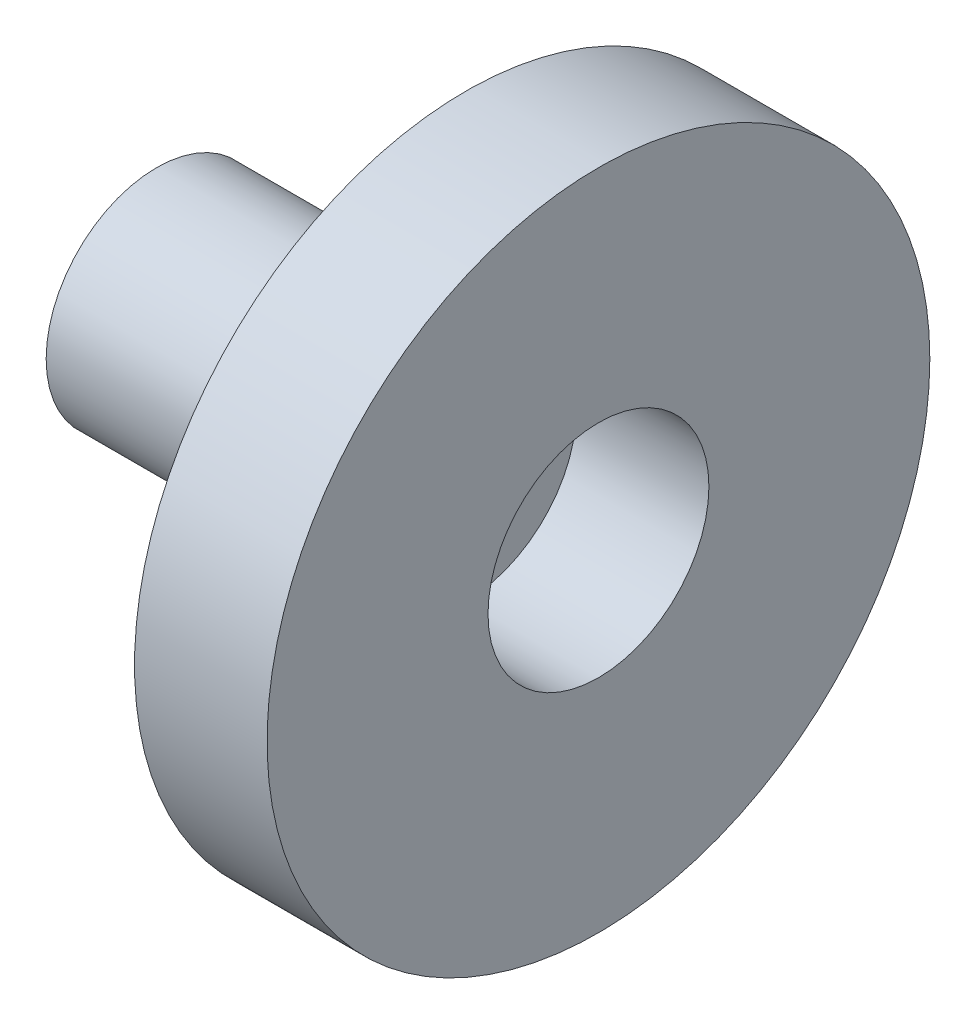
ISO-10303-21;
HEADER;
FILE_DESCRIPTION(('STEP AP214'),'2;1');
FILE_NAME('part.step','',(''),(''),'','','');
FILE_SCHEMA(('AUTOMOTIVE_DESIGN { 1 0 10303 214 1 1 1 1 }'));
ENDSEC;
DATA;
#1=APPLICATION_CONTEXT('core data for automotive mechanical design processes');
#2=APPLICATION_PROTOCOL_DEFINITION('international standard','automotive_design',2000,#1);
#3=PRODUCT_CONTEXT('',#1,'mechanical');
#4=PRODUCT('Part','Part','',(#3));
#5=PRODUCT_RELATED_PRODUCT_CATEGORY('part','',(#4));
#6=PRODUCT_DEFINITION_FORMATION('','',#4);
#7=PRODUCT_DEFINITION_CONTEXT('part definition',#1,'design');
#8=PRODUCT_DEFINITION('design','',#6,#7);
#9=PRODUCT_DEFINITION_SHAPE('','',#8);
#10=(LENGTH_UNIT() NAMED_UNIT(*) SI_UNIT(.MILLI.,.METRE.));
#11=(NAMED_UNIT(*) PLANE_ANGLE_UNIT() SI_UNIT($,.RADIAN.));
#12=(NAMED_UNIT(*) SI_UNIT($,.STERADIAN.) SOLID_ANGLE_UNIT());
#13=UNCERTAINTY_MEASURE_WITH_UNIT(LENGTH_MEASURE(1.E-05),#10,'distance_accuracy_value','');
#14=(GEOMETRIC_REPRESENTATION_CONTEXT(3) GLOBAL_UNCERTAINTY_ASSIGNED_CONTEXT((#13)) GLOBAL_UNIT_ASSIGNED_CONTEXT((#10,
#11,#12)) REPRESENTATION_CONTEXT('',''));
#15=CARTESIAN_POINT('',(0.,0.,0.));
#16=DIRECTION('',(0.,0.,1.));
#17=DIRECTION('',(1.,0.,0.));
#18=AXIS2_PLACEMENT_3D('',#15,#16,#17);
#19=CARTESIAN_POINT('',(-14.,0.,0.));
#20=DIRECTION('',(1.,0.,0.));
#21=DIRECTION('',(0.,0.,-1.));
#22=AXIS2_PLACEMENT_3D('',#19,#20,#21);
#23=CYLINDRICAL_SURFACE('',#22,5.);
#24=CARTESIAN_POINT('',(-14.,0.,0.));
#25=DIRECTION('',(-1.,0.,0.));
#26=DIRECTION('',(0.,0.,1.));
#27=AXIS2_PLACEMENT_3D('',#24,#25,#26);
#28=CIRCLE('',#27,5.);
#29=CARTESIAN_POINT('',(-14.,0.,5.));
#30=VERTEX_POINT('',#29);
#31=EDGE_CURVE('E11',#30,#30,#28,.T.);
#32=ORIENTED_EDGE('',*,*,#31,.F.);
#33=EDGE_LOOP('',(#32));
#34=FACE_BOUND('',#33,.T.);
#35=CARTESIAN_POINT('',(0.,0.,0.));
#36=DIRECTION('',(-1.,0.,0.));
#37=DIRECTION('',(0.,0.,1.));
#38=AXIS2_PLACEMENT_3D('',#35,#36,#37);
#39=CIRCLE('',#38,5.);
#40=CARTESIAN_POINT('',(0.,0.,5.));
#41=VERTEX_POINT('',#40);
#42=EDGE_CURVE('E46',#41,#41,#39,.T.);
#43=ORIENTED_EDGE('',*,*,#42,.T.);
#44=EDGE_LOOP('',(#43));
#45=FACE_BOUND('',#44,.T.);
#46=ADVANCED_FACE('F43',(#34,#45),#23,.T.);
#47=CARTESIAN_POINT('',(-14.,0.,0.));
#48=DIRECTION('',(-1.,0.,0.));
#49=DIRECTION('',(0.,0.,1.));
#50=AXIS2_PLACEMENT_3D('',#47,#48,#49);
#51=PLANE('',#50);
#52=ORIENTED_EDGE('',*,*,#31,.T.);
#53=EDGE_LOOP('',(#52));
#54=FACE_BOUND('',#53,.T.);
#55=ADVANCED_FACE('F58',(#54),#51,.T.);
#56=CARTESIAN_POINT('',(0.,0.,0.));
#57=DIRECTION('',(-1.,0.,0.));
#58=DIRECTION('',(0.,0.,1.));
#59=AXIS2_PLACEMENT_3D('',#56,#57,#58);
#60=PLANE('',#59);
#61=ORIENTED_EDGE('',*,*,#42,.F.);
#62=EDGE_LOOP('',(#61));
#63=FACE_BOUND('',#62,.T.);
#64=ADVANCED_FACE('F56',(#63),#60,.F.);
#65=CLOSED_SHELL('',(#46,#55,#64));
#66=MANIFOLD_SOLID_BREP('B2',#65);
#67=CARTESIAN_POINT('',(6.,0.,0.));
#68=DIRECTION('',(-1.,0.,0.));
#69=DIRECTION('',(0.,0.,1.));
#70=AXIS2_PLACEMENT_3D('',#67,#68,#69);
#71=CYLINDRICAL_SURFACE('',#70,15.);
#72=CARTESIAN_POINT('',(6.,0.,0.));
#73=DIRECTION('',(1.,0.,0.));
#74=DIRECTION('',(0.,0.,-1.));
#75=AXIS2_PLACEMENT_3D('',#72,#73,#74);
#76=CIRCLE('',#75,15.);
#77=CARTESIAN_POINT('',(6.,0.,-15.));
#78=VERTEX_POINT('',#77);
#79=EDGE_CURVE('E42',#78,#78,#76,.T.);
#80=ORIENTED_EDGE('',*,*,#79,.F.);
#81=EDGE_LOOP('',(#80));
#82=FACE_BOUND('',#81,.T.);
#83=CARTESIAN_POINT('',(0.,0.,0.));
#84=DIRECTION('',(1.,0.,0.));
#85=DIRECTION('',(0.,0.,-1.));
#86=AXIS2_PLACEMENT_3D('',#83,#84,#85);
#87=CIRCLE('',#86,15.);
#88=CARTESIAN_POINT('',(0.,0.,-15.));
#89=VERTEX_POINT('',#88);
#90=EDGE_CURVE('E87',#89,#89,#87,.T.);
#91=ORIENTED_EDGE('',*,*,#90,.T.);
#92=EDGE_LOOP('',(#91));
#93=FACE_BOUND('',#92,.T.);
#94=ADVANCED_FACE('F84',(#82,#93),#71,.T.);
#95=CARTESIAN_POINT('',(6.,0.,0.));
#96=DIRECTION('',(1.,0.,0.));
#97=DIRECTION('',(0.,0.,-1.));
#98=AXIS2_PLACEMENT_3D('',#95,#96,#97);
#99=PLANE('',#98);
#100=ORIENTED_EDGE('',*,*,#79,.T.);
#101=EDGE_LOOP('',(#100));
#102=FACE_BOUND('',#101,.T.);
#103=CARTESIAN_POINT('',(6.,0.,0.));
#104=DIRECTION('',(1.,0.,0.));
#105=DIRECTION('',(0.,0.,-1.));
#106=AXIS2_PLACEMENT_3D('',#103,#104,#105);
#107=CIRCLE('',#106,5.);
#108=CARTESIAN_POINT('',(6.,0.,-5.));
#109=VERTEX_POINT('',#108);
#110=EDGE_CURVE('E101',#109,#109,#107,.T.);
#111=ORIENTED_EDGE('',*,*,#110,.F.);
#112=EDGE_LOOP('',(#111));
#113=FACE_BOUND('',#112,.T.);
#114=ADVANCED_FACE('F108',(#102,#113),#99,.T.);
#115=CARTESIAN_POINT('',(0.,0.,0.));
#116=DIRECTION('',(1.,0.,0.));
#117=DIRECTION('',(0.,0.,-1.));
#118=AXIS2_PLACEMENT_3D('',#115,#116,#117);
#119=PLANE('',#118);
#120=ORIENTED_EDGE('',*,*,#90,.F.);
#121=EDGE_LOOP('',(#120));
#122=FACE_BOUND('',#121,.T.);
#123=CARTESIAN_POINT('',(0.,0.,0.));
#124=DIRECTION('',(1.,0.,0.));
#125=DIRECTION('',(0.,0.,-1.));
#126=AXIS2_PLACEMENT_3D('',#123,#124,#125);
#127=CIRCLE('',#126,5.);
#128=CARTESIAN_POINT('',(0.,0.,-5.));
#129=VERTEX_POINT('',#128);
#130=EDGE_CURVE('E96',#129,#129,#127,.F.);
#131=ORIENTED_EDGE('',*,*,#130,.F.);
#132=EDGE_LOOP('',(#131));
#133=FACE_BOUND('',#132,.T.);
#134=ADVANCED_FACE('F110',(#122,#133),#119,.F.);
#135=CARTESIAN_POINT('',(-16.9705627484771,0.,0.));
#136=DIRECTION('',(1.,0.,0.));
#137=DIRECTION('',(0.,0.,-1.));
#138=AXIS2_PLACEMENT_3D('',#135,#136,#137);
#139=CYLINDRICAL_SURFACE('',#138,5.);
#140=ORIENTED_EDGE('',*,*,#130,.T.);
#141=EDGE_LOOP('',(#140));
#142=FACE_BOUND('',#141,.T.);
#143=ORIENTED_EDGE('',*,*,#110,.T.);
#144=EDGE_LOOP('',(#143));
#145=FACE_BOUND('',#144,.T.);
#146=ADVANCED_FACE('F106',(#142,#145),#139,.F.);
#147=CLOSED_SHELL('',(#94,#114,#134,#146));
#148=MANIFOLD_SOLID_BREP('B6',#147);
#149=ADVANCED_BREP_SHAPE_REPRESENTATION('',(#18,#66,#148),#14);
#150=SHAPE_DEFINITION_REPRESENTATION(#9,#149);
ENDSEC;
END-ISO-10303-21;
